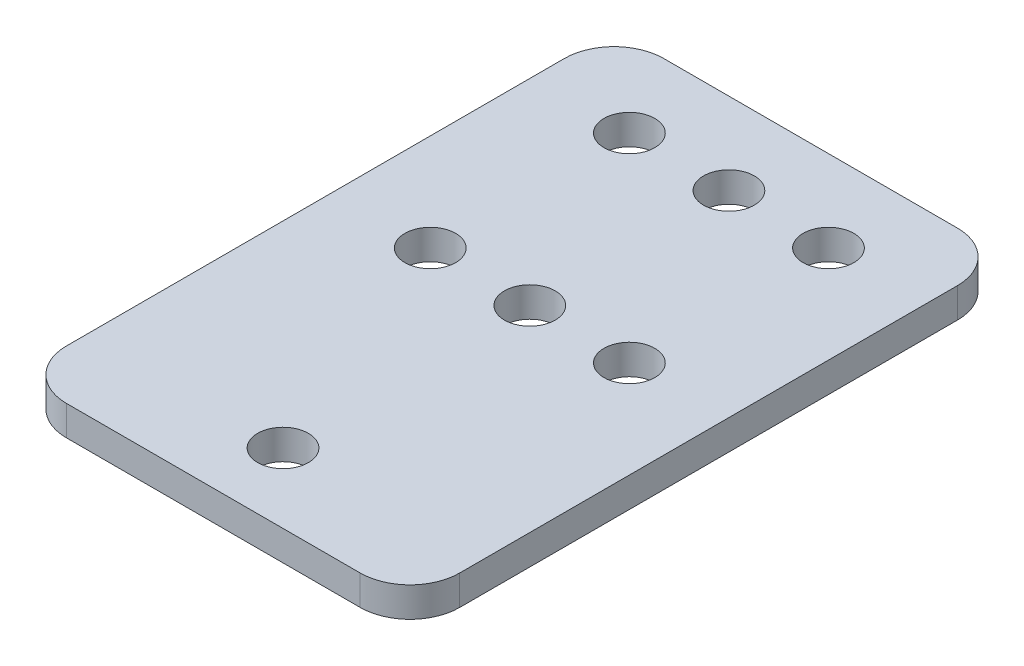
ISO-10303-21;
HEADER;
FILE_DESCRIPTION(('STEP AP214'),'2;1');
FILE_NAME('part.step','',(''),(''),'','','');
FILE_SCHEMA(('AUTOMOTIVE_DESIGN { 1 0 10303 214 1 1 1 1 }'));
ENDSEC;
DATA;
#1=APPLICATION_CONTEXT('core data for automotive mechanical design processes');
#2=APPLICATION_PROTOCOL_DEFINITION('international standard','automotive_design',2000,#1);
#3=PRODUCT_CONTEXT('',#1,'mechanical');
#4=PRODUCT('Part','Part','',(#3));
#5=PRODUCT_RELATED_PRODUCT_CATEGORY('part','',(#4));
#6=PRODUCT_DEFINITION_FORMATION('','',#4);
#7=PRODUCT_DEFINITION_CONTEXT('part definition',#1,'design');
#8=PRODUCT_DEFINITION('design','',#6,#7);
#9=PRODUCT_DEFINITION_SHAPE('','',#8);
#10=(LENGTH_UNIT() NAMED_UNIT(*) SI_UNIT(.MILLI.,.METRE.));
#11=(NAMED_UNIT(*) PLANE_ANGLE_UNIT() SI_UNIT($,.RADIAN.));
#12=(NAMED_UNIT(*) SI_UNIT($,.STERADIAN.) SOLID_ANGLE_UNIT());
#13=UNCERTAINTY_MEASURE_WITH_UNIT(LENGTH_MEASURE(1.E-05),#10,'distance_accuracy_value','');
#14=(GEOMETRIC_REPRESENTATION_CONTEXT(3) GLOBAL_UNCERTAINTY_ASSIGNED_CONTEXT((#13)) GLOBAL_UNIT_ASSIGNED_CONTEXT((#10,
#11,#12)) REPRESENTATION_CONTEXT('',''));
#15=CARTESIAN_POINT('',(0.,0.,0.));
#16=DIRECTION('',(0.,0.,1.));
#17=DIRECTION('',(1.,0.,0.));
#18=AXIS2_PLACEMENT_3D('',#15,#16,#17);
#19=CARTESIAN_POINT('',(19.75,3.,30.));
#20=DIRECTION('',(-1.,0.,0.));
#21=DIRECTION('',(0.,0.,1.));
#22=AXIS2_PLACEMENT_3D('',#19,#20,#21);
#23=PLANE('',#22);
#24=DIRECTION('',(0.,0.,-1.));
#25=VECTOR('',#24,1.);
#26=CARTESIAN_POINT('',(19.75,3.,30.));
#27=LINE('',#26,#25);
#28=CARTESIAN_POINT('',(19.75,3.,25.));
#29=VERTEX_POINT('',#28);
#30=CARTESIAN_POINT('',(19.75,3.,-25.));
#31=VERTEX_POINT('',#30);
#32=EDGE_CURVE('E130',#29,#31,#27,.T.);
#33=ORIENTED_EDGE('',*,*,#32,.F.);
#34=DIRECTION('',(0.,-1.,0.));
#35=VECTOR('',#34,1.);
#36=CARTESIAN_POINT('',(19.75,3.,25.));
#37=LINE('',#36,#35);
#38=CARTESIAN_POINT('',(19.75,0.,25.));
#39=VERTEX_POINT('',#38);
#40=EDGE_CURVE('E161',#29,#39,#37,.T.);
#41=ORIENTED_EDGE('',*,*,#40,.T.);
#42=DIRECTION('',(0.,0.,-1.));
#43=VECTOR('',#42,1.);
#44=CARTESIAN_POINT('',(19.75,0.,30.));
#45=LINE('',#44,#43);
#46=CARTESIAN_POINT('',(19.75,0.,-25.));
#47=VERTEX_POINT('',#46);
#48=EDGE_CURVE('E190',#39,#47,#45,.T.);
#49=ORIENTED_EDGE('',*,*,#48,.T.);
#50=DIRECTION('',(0.,-1.,0.));
#51=VECTOR('',#50,1.);
#52=CARTESIAN_POINT('',(19.75,3.,-25.));
#53=LINE('',#52,#51);
#54=EDGE_CURVE('E154',#47,#31,#53,.F.);
#55=ORIENTED_EDGE('',*,*,#54,.T.);
#56=EDGE_LOOP('',(#33,#41,#49,#55));
#57=FACE_BOUND('',#56,.T.);
#58=ADVANCED_FACE('F39',(#57),#23,.F.);
#59=CARTESIAN_POINT('',(-19.75,3.,-30.));
#60=DIRECTION('',(0.,0.,1.));
#61=DIRECTION('',(1.,0.,0.));
#62=AXIS2_PLACEMENT_3D('',#59,#60,#61);
#63=PLANE('',#62);
#64=DIRECTION('',(-1.,0.,0.));
#65=VECTOR('',#64,1.);
#66=CARTESIAN_POINT('',(-19.75,0.,-30.));
#67=LINE('',#66,#65);
#68=CARTESIAN_POINT('',(14.75,0.,-30.));
#69=VERTEX_POINT('',#68);
#70=CARTESIAN_POINT('',(-14.75,0.,-30.));
#71=VERTEX_POINT('',#70);
#72=EDGE_CURVE('E137',#69,#71,#67,.T.);
#73=ORIENTED_EDGE('',*,*,#72,.T.);
#74=DIRECTION('',(0.,-1.,0.));
#75=VECTOR('',#74,1.);
#76=CARTESIAN_POINT('',(-14.75,3.,-30.));
#77=LINE('',#76,#75);
#78=CARTESIAN_POINT('',(-14.75,3.,-30.));
#79=VERTEX_POINT('',#78);
#80=EDGE_CURVE('E48',#71,#79,#77,.F.);
#81=ORIENTED_EDGE('',*,*,#80,.T.);
#82=DIRECTION('',(-1.,0.,0.));
#83=VECTOR('',#82,1.);
#84=CARTESIAN_POINT('',(-19.75,3.,-30.));
#85=LINE('',#84,#83);
#86=CARTESIAN_POINT('',(14.75,3.,-30.));
#87=VERTEX_POINT('',#86);
#88=EDGE_CURVE('E135',#87,#79,#85,.T.);
#89=ORIENTED_EDGE('',*,*,#88,.F.);
#90=DIRECTION('',(0.,-1.,0.));
#91=VECTOR('',#90,1.);
#92=CARTESIAN_POINT('',(14.75,3.,-30.));
#93=LINE('',#92,#91);
#94=EDGE_CURVE('E146',#87,#69,#93,.T.);
#95=ORIENTED_EDGE('',*,*,#94,.T.);
#96=EDGE_LOOP('',(#73,#81,#89,#95));
#97=FACE_BOUND('',#96,.T.);
#98=ADVANCED_FACE('F194',(#97),#63,.F.);
#99=CARTESIAN_POINT('',(-19.75,3.,30.));
#100=DIRECTION('',(1.,0.,0.));
#101=DIRECTION('',(0.,0.,-1.));
#102=AXIS2_PLACEMENT_3D('',#99,#100,#101);
#103=PLANE('',#102);
#104=DIRECTION('',(0.,0.,1.));
#105=VECTOR('',#104,1.);
#106=CARTESIAN_POINT('',(-19.75,3.,30.));
#107=LINE('',#106,#105);
#108=CARTESIAN_POINT('',(-19.75,3.,-25.));
#109=VERTEX_POINT('',#108);
#110=CARTESIAN_POINT('',(-19.75,3.,25.));
#111=VERTEX_POINT('',#110);
#112=EDGE_CURVE('E181',#109,#111,#107,.T.);
#113=ORIENTED_EDGE('',*,*,#112,.F.);
#114=DIRECTION('',(0.,-1.,0.));
#115=VECTOR('',#114,1.);
#116=CARTESIAN_POINT('',(-19.75,3.,-25.));
#117=LINE('',#116,#115);
#118=CARTESIAN_POINT('',(-19.75,0.,-25.));
#119=VERTEX_POINT('',#118);
#120=EDGE_CURVE('E173',#109,#119,#117,.T.);
#121=ORIENTED_EDGE('',*,*,#120,.T.);
#122=DIRECTION('',(0.,0.,1.));
#123=VECTOR('',#122,1.);
#124=CARTESIAN_POINT('',(-19.75,0.,30.));
#125=LINE('',#124,#123);
#126=CARTESIAN_POINT('',(-19.75,0.,25.));
#127=VERTEX_POINT('',#126);
#128=EDGE_CURVE('E131',#119,#127,#125,.T.);
#129=ORIENTED_EDGE('',*,*,#128,.T.);
#130=DIRECTION('',(0.,-1.,0.));
#131=VECTOR('',#130,1.);
#132=CARTESIAN_POINT('',(-19.75,3.,25.));
#133=LINE('',#132,#131);
#134=EDGE_CURVE('E112',#127,#111,#133,.F.);
#135=ORIENTED_EDGE('',*,*,#134,.T.);
#136=EDGE_LOOP('',(#113,#121,#129,#135));
#137=FACE_BOUND('',#136,.T.);
#138=ADVANCED_FACE('F201',(#137),#103,.F.);
#139=CARTESIAN_POINT('',(-19.75,3.,30.));
#140=DIRECTION('',(0.,0.,-1.));
#141=DIRECTION('',(-1.,0.,0.));
#142=AXIS2_PLACEMENT_3D('',#139,#140,#141);
#143=PLANE('',#142);
#144=DIRECTION('',(1.,0.,0.));
#145=VECTOR('',#144,1.);
#146=CARTESIAN_POINT('',(-19.75,0.,30.));
#147=LINE('',#146,#145);
#148=CARTESIAN_POINT('',(-14.75,0.,30.));
#149=VERTEX_POINT('',#148);
#150=CARTESIAN_POINT('',(14.75,0.,30.));
#151=VERTEX_POINT('',#150);
#152=EDGE_CURVE('E120',#149,#151,#147,.T.);
#153=ORIENTED_EDGE('',*,*,#152,.T.);
#154=DIRECTION('',(0.,-1.,0.));
#155=VECTOR('',#154,1.);
#156=CARTESIAN_POINT('',(14.75,3.,30.));
#157=LINE('',#156,#155);
#158=CARTESIAN_POINT('',(14.75,3.,30.));
#159=VERTEX_POINT('',#158);
#160=EDGE_CURVE('E167',#151,#159,#157,.F.);
#161=ORIENTED_EDGE('',*,*,#160,.T.);
#162=DIRECTION('',(1.,0.,0.));
#163=VECTOR('',#162,1.);
#164=CARTESIAN_POINT('',(-19.75,3.,30.));
#165=LINE('',#164,#163);
#166=CARTESIAN_POINT('',(-14.75,3.,30.));
#167=VERTEX_POINT('',#166);
#168=EDGE_CURVE('E123',#167,#159,#165,.T.);
#169=ORIENTED_EDGE('',*,*,#168,.F.);
#170=DIRECTION('',(0.,-1.,0.));
#171=VECTOR('',#170,1.);
#172=CARTESIAN_POINT('',(-14.75,3.,30.));
#173=LINE('',#172,#171);
#174=EDGE_CURVE('E110',#167,#149,#173,.T.);
#175=ORIENTED_EDGE('',*,*,#174,.T.);
#176=EDGE_LOOP('',(#153,#161,#169,#175));
#177=FACE_BOUND('',#176,.T.);
#178=ADVANCED_FACE('F119',(#177),#143,.F.);
#179=CARTESIAN_POINT('',(0.,3.,0.));
#180=DIRECTION('',(0.,-1.,0.));
#181=DIRECTION('',(0.,0.,-1.));
#182=AXIS2_PLACEMENT_3D('',#179,#180,#181);
#183=PLANE('',#182);
#184=CARTESIAN_POINT('',(10.,3.,-1.79));
#185=DIRECTION('',(0.,1.,0.));
#186=DIRECTION('',(0.,0.,1.));
#187=AXIS2_PLACEMENT_3D('',#184,#185,#186);
#188=CIRCLE('',#187,2.55);
#189=CARTESIAN_POINT('',(10.,3.,0.760000000000003));
#190=VERTEX_POINT('',#189);
#191=EDGE_CURVE('E271',#190,#190,#188,.T.);
#192=ORIENTED_EDGE('',*,*,#191,.F.);
#193=EDGE_LOOP('',(#192));
#194=FACE_BOUND('',#193,.T.);
#195=CARTESIAN_POINT('',(-10.,3.,-1.79));
#196=DIRECTION('',(0.,1.,0.));
#197=DIRECTION('',(0.,0.,1.));
#198=AXIS2_PLACEMENT_3D('',#195,#196,#197);
#199=CIRCLE('',#198,2.55);
#200=CARTESIAN_POINT('',(-10.,3.,0.760000000000003));
#201=VERTEX_POINT('',#200);
#202=EDGE_CURVE('E280',#201,#201,#199,.T.);
#203=ORIENTED_EDGE('',*,*,#202,.F.);
#204=EDGE_LOOP('',(#203));
#205=FACE_BOUND('',#204,.T.);
#206=CARTESIAN_POINT('',(0.,3.,-1.79));
#207=DIRECTION('',(0.,1.,0.));
#208=DIRECTION('',(0.,0.,1.));
#209=AXIS2_PLACEMENT_3D('',#206,#207,#208);
#210=CIRCLE('',#209,2.55);
#211=CARTESIAN_POINT('',(0.,3.,0.760000000000003));
#212=VERTEX_POINT('',#211);
#213=EDGE_CURVE('E277',#212,#212,#210,.T.);
#214=ORIENTED_EDGE('',*,*,#213,.F.);
#215=EDGE_LOOP('',(#214));
#216=FACE_BOUND('',#215,.T.);
#217=CARTESIAN_POINT('',(-10.,3.,-21.79));
#218=DIRECTION('',(0.,1.,0.));
#219=DIRECTION('',(0.,0.,1.));
#220=AXIS2_PLACEMENT_3D('',#217,#218,#219);
#221=CIRCLE('',#220,2.55);
#222=CARTESIAN_POINT('',(-10.,3.,-19.24));
#223=VERTEX_POINT('',#222);
#224=EDGE_CURVE('E298',#223,#223,#221,.T.);
#225=ORIENTED_EDGE('',*,*,#224,.F.);
#226=EDGE_LOOP('',(#225));
#227=FACE_BOUND('',#226,.T.);
#228=CARTESIAN_POINT('',(10.,3.,-21.79));
#229=DIRECTION('',(0.,1.,0.));
#230=DIRECTION('',(0.,0.,1.));
#231=AXIS2_PLACEMENT_3D('',#228,#229,#230);
#232=CIRCLE('',#231,2.55);
#233=CARTESIAN_POINT('',(10.,3.,-19.24));
#234=VERTEX_POINT('',#233);
#235=EDGE_CURVE('E299',#234,#234,#232,.T.);
#236=ORIENTED_EDGE('',*,*,#235,.F.);
#237=EDGE_LOOP('',(#236));
#238=FACE_BOUND('',#237,.T.);
#239=CARTESIAN_POINT('',(0.,3.,23.));
#240=DIRECTION('',(0.,1.,0.));
#241=DIRECTION('',(0.,0.,1.));
#242=AXIS2_PLACEMENT_3D('',#239,#240,#241);
#243=CIRCLE('',#242,2.55);
#244=CARTESIAN_POINT('',(0.,3.,25.55));
#245=VERTEX_POINT('',#244);
#246=EDGE_CURVE('E303',#245,#245,#243,.T.);
#247=ORIENTED_EDGE('',*,*,#246,.F.);
#248=EDGE_LOOP('',(#247));
#249=FACE_BOUND('',#248,.T.);
#250=CARTESIAN_POINT('',(0.,3.,-21.79));
#251=DIRECTION('',(0.,1.,0.));
#252=DIRECTION('',(0.,0.,1.));
#253=AXIS2_PLACEMENT_3D('',#250,#251,#252);
#254=CIRCLE('',#253,2.55);
#255=CARTESIAN_POINT('',(0.,3.,-19.24));
#256=VERTEX_POINT('',#255);
#257=EDGE_CURVE('E314',#256,#256,#254,.T.);
#258=ORIENTED_EDGE('',*,*,#257,.F.);
#259=EDGE_LOOP('',(#258));
#260=FACE_BOUND('',#259,.T.);
#261=ORIENTED_EDGE('',*,*,#88,.T.);
#262=CARTESIAN_POINT('',(-14.75,3.,-25.));
#263=DIRECTION('',(0.,-1.,0.));
#264=DIRECTION('',(0.,0.,-1.));
#265=AXIS2_PLACEMENT_3D('',#262,#263,#264);
#266=CIRCLE('',#265,5.);
#267=EDGE_CURVE('E11',#79,#109,#266,.F.);
#268=ORIENTED_EDGE('',*,*,#267,.T.);
#269=ORIENTED_EDGE('',*,*,#112,.T.);
#270=CARTESIAN_POINT('',(-14.75,3.,25.));
#271=DIRECTION('',(0.,-1.,0.));
#272=DIRECTION('',(0.,0.,-1.));
#273=AXIS2_PLACEMENT_3D('',#270,#271,#272);
#274=CIRCLE('',#273,5.);
#275=EDGE_CURVE('E143',#111,#167,#274,.F.);
#276=ORIENTED_EDGE('',*,*,#275,.T.);
#277=ORIENTED_EDGE('',*,*,#168,.T.);
#278=CARTESIAN_POINT('',(14.75,3.,25.));
#279=DIRECTION('',(0.,-1.,0.));
#280=DIRECTION('',(0.,0.,-1.));
#281=AXIS2_PLACEMENT_3D('',#278,#279,#280);
#282=CIRCLE('',#281,5.);
#283=EDGE_CURVE('E170',#159,#29,#282,.F.);
#284=ORIENTED_EDGE('',*,*,#283,.T.);
#285=ORIENTED_EDGE('',*,*,#32,.T.);
#286=CARTESIAN_POINT('',(14.75,3.,-25.));
#287=DIRECTION('',(0.,-1.,0.));
#288=DIRECTION('',(0.,0.,-1.));
#289=AXIS2_PLACEMENT_3D('',#286,#287,#288);
#290=CIRCLE('',#289,5.);
#291=EDGE_CURVE('E158',#31,#87,#290,.F.);
#292=ORIENTED_EDGE('',*,*,#291,.T.);
#293=EDGE_LOOP('',(#261,#268,#269,#276,#277,#284,#285,#292));
#294=FACE_BOUND('',#293,.T.);
#295=ADVANCED_FACE('F199',(#194,#205,#216,#227,#238,#249,#260,#294),#183,.F.);
#296=CARTESIAN_POINT('',(0.,0.,0.));
#297=DIRECTION('',(0.,-1.,0.));
#298=DIRECTION('',(0.,0.,-1.));
#299=AXIS2_PLACEMENT_3D('',#296,#297,#298);
#300=PLANE('',#299);
#301=CARTESIAN_POINT('',(10.,0.,-1.79));
#302=DIRECTION('',(0.,1.,0.));
#303=DIRECTION('',(0.,0.,1.));
#304=AXIS2_PLACEMENT_3D('',#301,#302,#303);
#305=CIRCLE('',#304,2.55);
#306=CARTESIAN_POINT('',(10.,0.,0.760000000000003));
#307=VERTEX_POINT('',#306);
#308=EDGE_CURVE('E268',#307,#307,#305,.T.);
#309=ORIENTED_EDGE('',*,*,#308,.T.);
#310=EDGE_LOOP('',(#309));
#311=FACE_BOUND('',#310,.T.);
#312=CARTESIAN_POINT('',(-10.,0.,-1.79));
#313=DIRECTION('',(0.,1.,0.));
#314=DIRECTION('',(0.,0.,1.));
#315=AXIS2_PLACEMENT_3D('',#312,#313,#314);
#316=CIRCLE('',#315,2.55);
#317=CARTESIAN_POINT('',(-10.,0.,0.760000000000003));
#318=VERTEX_POINT('',#317);
#319=EDGE_CURVE('E273',#318,#318,#316,.T.);
#320=ORIENTED_EDGE('',*,*,#319,.T.);
#321=EDGE_LOOP('',(#320));
#322=FACE_BOUND('',#321,.T.);
#323=CARTESIAN_POINT('',(0.,0.,-1.79));
#324=DIRECTION('',(0.,1.,0.));
#325=DIRECTION('',(0.,0.,1.));
#326=AXIS2_PLACEMENT_3D('',#323,#324,#325);
#327=CIRCLE('',#326,2.55);
#328=CARTESIAN_POINT('',(0.,0.,0.760000000000003));
#329=VERTEX_POINT('',#328);
#330=EDGE_CURVE('E286',#329,#329,#327,.T.);
#331=ORIENTED_EDGE('',*,*,#330,.T.);
#332=EDGE_LOOP('',(#331));
#333=FACE_BOUND('',#332,.T.);
#334=CARTESIAN_POINT('',(-10.,0.,-21.79));
#335=DIRECTION('',(0.,1.,0.));
#336=DIRECTION('',(0.,0.,1.));
#337=AXIS2_PLACEMENT_3D('',#334,#335,#336);
#338=CIRCLE('',#337,2.55);
#339=CARTESIAN_POINT('',(-10.,0.,-19.24));
#340=VERTEX_POINT('',#339);
#341=EDGE_CURVE('E294',#340,#340,#338,.T.);
#342=ORIENTED_EDGE('',*,*,#341,.T.);
#343=EDGE_LOOP('',(#342));
#344=FACE_BOUND('',#343,.T.);
#345=CARTESIAN_POINT('',(10.,0.,-21.79));
#346=DIRECTION('',(0.,1.,0.));
#347=DIRECTION('',(0.,0.,1.));
#348=AXIS2_PLACEMENT_3D('',#345,#346,#347);
#349=CIRCLE('',#348,2.55);
#350=CARTESIAN_POINT('',(10.,0.,-19.24));
#351=VERTEX_POINT('',#350);
#352=EDGE_CURVE('E290',#351,#351,#349,.T.);
#353=ORIENTED_EDGE('',*,*,#352,.T.);
#354=EDGE_LOOP('',(#353));
#355=FACE_BOUND('',#354,.T.);
#356=CARTESIAN_POINT('',(0.,0.,23.));
#357=DIRECTION('',(0.,1.,0.));
#358=DIRECTION('',(0.,0.,1.));
#359=AXIS2_PLACEMENT_3D('',#356,#357,#358);
#360=CIRCLE('',#359,2.55);
#361=CARTESIAN_POINT('',(0.,0.,25.55));
#362=VERTEX_POINT('',#361);
#363=EDGE_CURVE('E310',#362,#362,#360,.T.);
#364=ORIENTED_EDGE('',*,*,#363,.T.);
#365=EDGE_LOOP('',(#364));
#366=FACE_BOUND('',#365,.T.);
#367=CARTESIAN_POINT('',(0.,0.,-21.79));
#368=DIRECTION('',(0.,1.,0.));
#369=DIRECTION('',(0.,0.,1.));
#370=AXIS2_PLACEMENT_3D('',#367,#368,#369);
#371=CIRCLE('',#370,2.55);
#372=CARTESIAN_POINT('',(0.,0.,-19.24));
#373=VERTEX_POINT('',#372);
#374=EDGE_CURVE('E192',#373,#373,#371,.T.);
#375=ORIENTED_EDGE('',*,*,#374,.T.);
#376=EDGE_LOOP('',(#375));
#377=FACE_BOUND('',#376,.T.);
#378=ORIENTED_EDGE('',*,*,#128,.F.);
#379=CARTESIAN_POINT('',(-14.75,0.,-25.));
#380=DIRECTION('',(0.,-1.,0.));
#381=DIRECTION('',(0.,0.,-1.));
#382=AXIS2_PLACEMENT_3D('',#379,#380,#381);
#383=CIRCLE('',#382,5.);
#384=EDGE_CURVE('E62',#119,#71,#383,.T.);
#385=ORIENTED_EDGE('',*,*,#384,.T.);
#386=ORIENTED_EDGE('',*,*,#72,.F.);
#387=CARTESIAN_POINT('',(14.75,0.,-25.));
#388=DIRECTION('',(0.,-1.,0.));
#389=DIRECTION('',(0.,0.,-1.));
#390=AXIS2_PLACEMENT_3D('',#387,#388,#389);
#391=CIRCLE('',#390,5.);
#392=EDGE_CURVE('E150',#69,#47,#391,.T.);
#393=ORIENTED_EDGE('',*,*,#392,.T.);
#394=ORIENTED_EDGE('',*,*,#48,.F.);
#395=CARTESIAN_POINT('',(14.75,0.,25.));
#396=DIRECTION('',(0.,-1.,0.));
#397=DIRECTION('',(0.,0.,-1.));
#398=AXIS2_PLACEMENT_3D('',#395,#396,#397);
#399=CIRCLE('',#398,5.);
#400=EDGE_CURVE('E128',#39,#151,#399,.T.);
#401=ORIENTED_EDGE('',*,*,#400,.T.);
#402=ORIENTED_EDGE('',*,*,#152,.F.);
#403=CARTESIAN_POINT('',(-14.75,0.,25.));
#404=DIRECTION('',(0.,-1.,0.));
#405=DIRECTION('',(0.,0.,-1.));
#406=AXIS2_PLACEMENT_3D('',#403,#404,#405);
#407=CIRCLE('',#406,5.);
#408=EDGE_CURVE('E106',#149,#127,#407,.T.);
#409=ORIENTED_EDGE('',*,*,#408,.T.);
#410=EDGE_LOOP('',(#378,#385,#386,#393,#394,#401,#402,#409));
#411=FACE_BOUND('',#410,.T.);
#412=ADVANCED_FACE('F126',(#311,#322,#333,#344,#355,#366,#377,#411),#300,.T.);
#413=CARTESIAN_POINT('',(0.,0.,-21.79));
#414=DIRECTION('',(0.,1.,0.));
#415=DIRECTION('',(0.,0.,1.));
#416=AXIS2_PLACEMENT_3D('',#413,#414,#415);
#417=CYLINDRICAL_SURFACE('',#416,2.55);
#418=ORIENTED_EDGE('',*,*,#374,.F.);
#419=EDGE_LOOP('',(#418));
#420=FACE_BOUND('',#419,.T.);
#421=ORIENTED_EDGE('',*,*,#257,.T.);
#422=EDGE_LOOP('',(#421));
#423=FACE_BOUND('',#422,.T.);
#424=ADVANCED_FACE('F233',(#420,#423),#417,.F.);
#425=CARTESIAN_POINT('',(0.,0.,23.));
#426=DIRECTION('',(0.,1.,0.));
#427=DIRECTION('',(0.,0.,1.));
#428=AXIS2_PLACEMENT_3D('',#425,#426,#427);
#429=CYLINDRICAL_SURFACE('',#428,2.55);
#430=ORIENTED_EDGE('',*,*,#363,.F.);
#431=EDGE_LOOP('',(#430));
#432=FACE_BOUND('',#431,.T.);
#433=ORIENTED_EDGE('',*,*,#246,.T.);
#434=EDGE_LOOP('',(#433));
#435=FACE_BOUND('',#434,.T.);
#436=ADVANCED_FACE('F240',(#432,#435),#429,.F.);
#437=CARTESIAN_POINT('',(10.,0.,-21.79));
#438=DIRECTION('',(0.,1.,0.));
#439=DIRECTION('',(0.,0.,1.));
#440=AXIS2_PLACEMENT_3D('',#437,#438,#439);
#441=CYLINDRICAL_SURFACE('',#440,2.55);
#442=ORIENTED_EDGE('',*,*,#352,.F.);
#443=EDGE_LOOP('',(#442));
#444=FACE_BOUND('',#443,.T.);
#445=ORIENTED_EDGE('',*,*,#235,.T.);
#446=EDGE_LOOP('',(#445));
#447=FACE_BOUND('',#446,.T.);
#448=ADVANCED_FACE('F244',(#444,#447),#441,.F.);
#449=CARTESIAN_POINT('',(-10.,0.,-21.79));
#450=DIRECTION('',(0.,1.,0.));
#451=DIRECTION('',(0.,0.,1.));
#452=AXIS2_PLACEMENT_3D('',#449,#450,#451);
#453=CYLINDRICAL_SURFACE('',#452,2.55);
#454=ORIENTED_EDGE('',*,*,#341,.F.);
#455=EDGE_LOOP('',(#454));
#456=FACE_BOUND('',#455,.T.);
#457=ORIENTED_EDGE('',*,*,#224,.T.);
#458=EDGE_LOOP('',(#457));
#459=FACE_BOUND('',#458,.T.);
#460=ADVANCED_FACE('F248',(#456,#459),#453,.F.);
#461=CARTESIAN_POINT('',(0.,0.,-1.79));
#462=DIRECTION('',(0.,1.,0.));
#463=DIRECTION('',(0.,0.,1.));
#464=AXIS2_PLACEMENT_3D('',#461,#462,#463);
#465=CYLINDRICAL_SURFACE('',#464,2.55);
#466=ORIENTED_EDGE('',*,*,#330,.F.);
#467=EDGE_LOOP('',(#466));
#468=FACE_BOUND('',#467,.T.);
#469=ORIENTED_EDGE('',*,*,#213,.T.);
#470=EDGE_LOOP('',(#469));
#471=FACE_BOUND('',#470,.T.);
#472=ADVANCED_FACE('F252',(#468,#471),#465,.F.);
#473=CARTESIAN_POINT('',(-10.,0.,-1.79));
#474=DIRECTION('',(0.,1.,0.));
#475=DIRECTION('',(0.,0.,1.));
#476=AXIS2_PLACEMENT_3D('',#473,#474,#475);
#477=CYLINDRICAL_SURFACE('',#476,2.55);
#478=ORIENTED_EDGE('',*,*,#319,.F.);
#479=EDGE_LOOP('',(#478));
#480=FACE_BOUND('',#479,.T.);
#481=ORIENTED_EDGE('',*,*,#202,.T.);
#482=EDGE_LOOP('',(#481));
#483=FACE_BOUND('',#482,.T.);
#484=ADVANCED_FACE('F256',(#480,#483),#477,.F.);
#485=CARTESIAN_POINT('',(10.,0.,-1.79));
#486=DIRECTION('',(0.,1.,0.));
#487=DIRECTION('',(0.,0.,1.));
#488=AXIS2_PLACEMENT_3D('',#485,#486,#487);
#489=CYLINDRICAL_SURFACE('',#488,2.55);
#490=ORIENTED_EDGE('',*,*,#308,.F.);
#491=EDGE_LOOP('',(#490));
#492=FACE_BOUND('',#491,.T.);
#493=ORIENTED_EDGE('',*,*,#191,.T.);
#494=EDGE_LOOP('',(#493));
#495=FACE_BOUND('',#494,.T.);
#496=ADVANCED_FACE('F218',(#492,#495),#489,.F.);
#497=CARTESIAN_POINT('',(-14.75,3.,25.));
#498=DIRECTION('',(0.,-1.,0.));
#499=DIRECTION('',(0.,0.,-1.));
#500=AXIS2_PLACEMENT_3D('',#497,#498,#499);
#501=CYLINDRICAL_SURFACE('',#500,5.);
#502=ORIENTED_EDGE('',*,*,#275,.F.);
#503=ORIENTED_EDGE('',*,*,#134,.F.);
#504=ORIENTED_EDGE('',*,*,#408,.F.);
#505=ORIENTED_EDGE('',*,*,#174,.F.);
#506=EDGE_LOOP('',(#502,#503,#504,#505));
#507=FACE_BOUND('',#506,.T.);
#508=ADVANCED_FACE('F109',(#507),#501,.T.);
#509=CARTESIAN_POINT('',(14.75,3.,-25.));
#510=DIRECTION('',(0.,-1.,0.));
#511=DIRECTION('',(0.,0.,-1.));
#512=AXIS2_PLACEMENT_3D('',#509,#510,#511);
#513=CYLINDRICAL_SURFACE('',#512,5.);
#514=ORIENTED_EDGE('',*,*,#291,.F.);
#515=ORIENTED_EDGE('',*,*,#54,.F.);
#516=ORIENTED_EDGE('',*,*,#392,.F.);
#517=ORIENTED_EDGE('',*,*,#94,.F.);
#518=EDGE_LOOP('',(#514,#515,#516,#517));
#519=FACE_BOUND('',#518,.T.);
#520=ADVANCED_FACE('F211',(#519),#513,.T.);
#521=CARTESIAN_POINT('',(14.75,3.,25.));
#522=DIRECTION('',(0.,-1.,0.));
#523=DIRECTION('',(0.,0.,-1.));
#524=AXIS2_PLACEMENT_3D('',#521,#522,#523);
#525=CYLINDRICAL_SURFACE('',#524,5.);
#526=ORIENTED_EDGE('',*,*,#283,.F.);
#527=ORIENTED_EDGE('',*,*,#160,.F.);
#528=ORIENTED_EDGE('',*,*,#400,.F.);
#529=ORIENTED_EDGE('',*,*,#40,.F.);
#530=EDGE_LOOP('',(#526,#527,#528,#529));
#531=FACE_BOUND('',#530,.T.);
#532=ADVANCED_FACE('F206',(#531),#525,.T.);
#533=CARTESIAN_POINT('',(-14.75,3.,-25.));
#534=DIRECTION('',(0.,-1.,0.));
#535=DIRECTION('',(0.,0.,-1.));
#536=AXIS2_PLACEMENT_3D('',#533,#534,#535);
#537=CYLINDRICAL_SURFACE('',#536,5.);
#538=ORIENTED_EDGE('',*,*,#267,.F.);
#539=ORIENTED_EDGE('',*,*,#80,.F.);
#540=ORIENTED_EDGE('',*,*,#384,.F.);
#541=ORIENTED_EDGE('',*,*,#120,.F.);
#542=EDGE_LOOP('',(#538,#539,#540,#541));
#543=FACE_BOUND('',#542,.T.);
#544=ADVANCED_FACE('F41',(#543),#537,.T.);
#545=CLOSED_SHELL('',(#58,#98,#138,#178,#295,#412,#424,#436,#448,#460,#472,#484,#496,#508,#520,
#532,#544));
#546=MANIFOLD_SOLID_BREP('B2',#545);
#547=ADVANCED_BREP_SHAPE_REPRESENTATION('',(#18,#546),#14);
#548=SHAPE_DEFINITION_REPRESENTATION(#9,#547);
ENDSEC;
END-ISO-10303-21;
